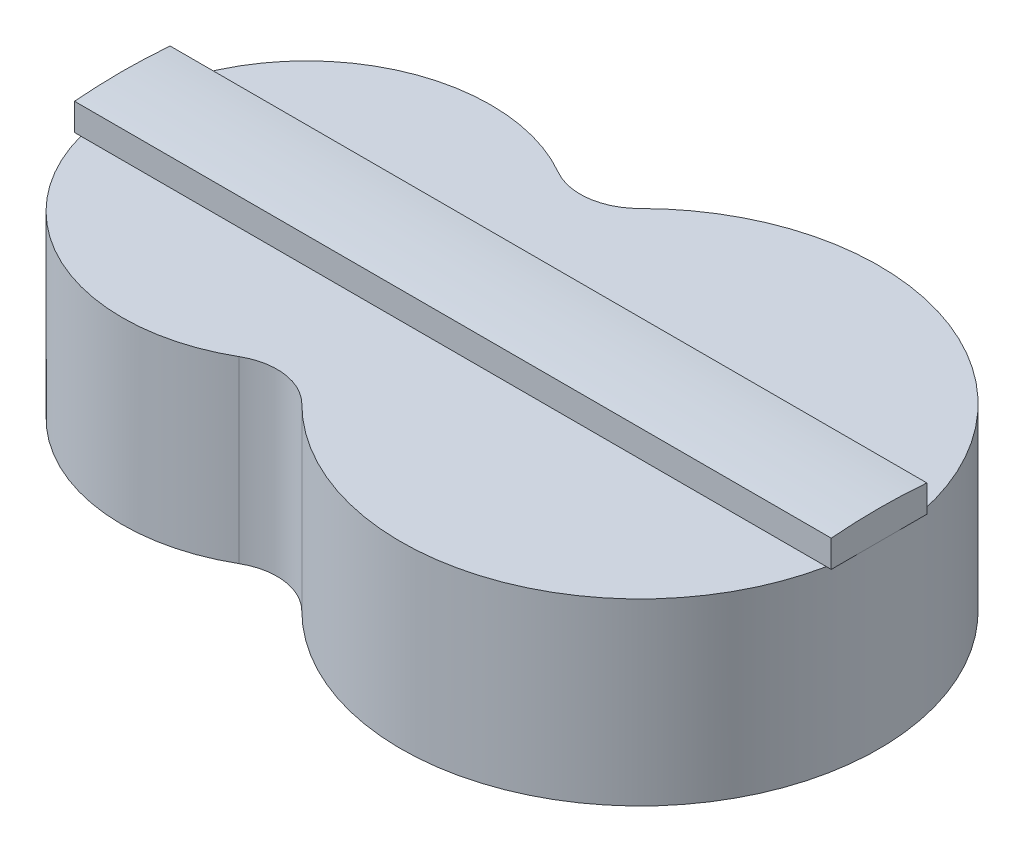
ISO-10303-21;
HEADER;
FILE_DESCRIPTION(('STEP AP214'),'2;1');
FILE_NAME('part.step','',(''),(''),'','','');
FILE_SCHEMA(('AUTOMOTIVE_DESIGN { 1 0 10303 214 1 1 1 1 }'));
ENDSEC;
DATA;
#1=APPLICATION_CONTEXT('core data for automotive mechanical design processes');
#2=APPLICATION_PROTOCOL_DEFINITION('international standard','automotive_design',2000,#1);
#3=PRODUCT_CONTEXT('',#1,'mechanical');
#4=PRODUCT('Part','Part','',(#3));
#5=PRODUCT_RELATED_PRODUCT_CATEGORY('part','',(#4));
#6=PRODUCT_DEFINITION_FORMATION('','',#4);
#7=PRODUCT_DEFINITION_CONTEXT('part definition',#1,'design');
#8=PRODUCT_DEFINITION('design','',#6,#7);
#9=PRODUCT_DEFINITION_SHAPE('','',#8);
#10=(LENGTH_UNIT() NAMED_UNIT(*) SI_UNIT(.MILLI.,.METRE.));
#11=(NAMED_UNIT(*) PLANE_ANGLE_UNIT() SI_UNIT($,.RADIAN.));
#12=(NAMED_UNIT(*) SI_UNIT($,.STERADIAN.) SOLID_ANGLE_UNIT());
#13=UNCERTAINTY_MEASURE_WITH_UNIT(LENGTH_MEASURE(1.E-05),#10,'distance_accuracy_value','');
#14=(GEOMETRIC_REPRESENTATION_CONTEXT(3) GLOBAL_UNCERTAINTY_ASSIGNED_CONTEXT((#13)) GLOBAL_UNIT_ASSIGNED_CONTEXT((#10,
#11,#12)) REPRESENTATION_CONTEXT('',''));
#15=CARTESIAN_POINT('',(0.,0.,0.));
#16=DIRECTION('',(0.,0.,1.));
#17=DIRECTION('',(1.,0.,0.));
#18=AXIS2_PLACEMENT_3D('',#15,#16,#17);
#19=CARTESIAN_POINT('',(-113.90386580231,0.,-44.194173824159));
#20=DIRECTION('',(0.,-1.,0.));
#21=DIRECTION('',(0.,0.,-1.));
#22=AXIS2_PLACEMENT_3D('',#19,#20,#21);
#23=PLANE('',#22);
#24=DIRECTION('',(-1.,0.,0.));
#25=VECTOR('',#24,1.);
#26=CARTESIAN_POINT('',(100.,0.,-20.));
#27=LINE('',#26,#25);
#28=CARTESIAN_POINT('',(97.9795897113271,0.,-20.));
#29=VERTEX_POINT('',#28);
#30=CARTESIAN_POINT('',(-213.840906621914,0.,-20.));
#31=VERTEX_POINT('',#30);
#32=EDGE_CURVE('E49',#29,#31,#27,.T.);
#33=ORIENTED_EDGE('',*,*,#32,.F.);
#34=CARTESIAN_POINT('',(0.,0.,0.));
#35=DIRECTION('',(0.,1.,0.));
#36=DIRECTION('',(0.,0.,1.));
#37=AXIS2_PLACEMENT_3D('',#34,#35,#36);
#38=CIRCLE('',#37,100.);
#39=CARTESIAN_POINT('',(-70.7106781186552,0.,-70.7106781186543));
#40=VERTEX_POINT('',#39);
#41=EDGE_CURVE('E194',#29,#40,#38,.T.);
#42=ORIENTED_EDGE('',*,*,#41,.T.);
#43=CARTESIAN_POINT('',(-88.3883476483189,0.,-88.3883476483179));
#44=DIRECTION('',(0.,-1.,0.));
#45=DIRECTION('',(0.,0.,-1.));
#46=AXIS2_PLACEMENT_3D('',#43,#44,#45);
#47=CIRCLE('',#46,25.);
#48=CARTESIAN_POINT('',(-100.888347648319,0.,-66.7377125537069));
#49=VERTEX_POINT('',#48);
#50=EDGE_CURVE('E135',#40,#49,#47,.T.);
#51=ORIENTED_EDGE('',*,*,#50,.T.);
#52=CARTESIAN_POINT('',(-139.419383956301,0.,0.));
#53=DIRECTION('',(0.,1.,0.));
#54=DIRECTION('',(0.,0.,1.));
#55=AXIS2_PLACEMENT_3D('',#52,#53,#54);
#56=CIRCLE('',#55,77.062072615965);
#57=EDGE_CURVE('E188',#49,#31,#56,.T.);
#58=ORIENTED_EDGE('',*,*,#57,.T.);
#59=EDGE_LOOP('',(#33,#42,#51,#58));
#60=FACE_BOUND('',#59,.T.);
#61=ADVANCED_FACE('F40',(#60),#23,.F.);
#62=CARTESIAN_POINT('',(-88.3883476483189,-75.,-88.3883476483179));
#63=DIRECTION('',(0.,1.,0.));
#64=DIRECTION('',(0.,0.,1.));
#65=AXIS2_PLACEMENT_3D('',#62,#63,#64);
#66=CYLINDRICAL_SURFACE('',#65,25.);
#67=ORIENTED_EDGE('',*,*,#50,.F.);
#68=DIRECTION('',(0.,1.,0.));
#69=VECTOR('',#68,1.);
#70=CARTESIAN_POINT('',(-70.7106781186552,-75.,-70.7106781186543));
#71=LINE('',#70,#69);
#72=CARTESIAN_POINT('',(-70.7106781186552,-75.,-70.7106781186543));
#73=VERTEX_POINT('',#72);
#74=EDGE_CURVE('E198',#73,#40,#71,.T.);
#75=ORIENTED_EDGE('',*,*,#74,.F.);
#76=CARTESIAN_POINT('',(-88.3883476483189,-75.,-88.3883476483179));
#77=DIRECTION('',(0.,-1.,0.));
#78=DIRECTION('',(0.,0.,-1.));
#79=AXIS2_PLACEMENT_3D('',#76,#77,#78);
#80=CIRCLE('',#79,25.);
#81=CARTESIAN_POINT('',(-100.888347648319,-75.,-66.7377125537069));
#82=VERTEX_POINT('',#81);
#83=EDGE_CURVE('E172',#73,#82,#80,.T.);
#84=ORIENTED_EDGE('',*,*,#83,.T.);
#85=DIRECTION('',(0.,1.,0.));
#86=VECTOR('',#85,1.);
#87=CARTESIAN_POINT('',(-100.888347648319,-75.,-66.7377125537069));
#88=LINE('',#87,#86);
#89=EDGE_CURVE('E44',#82,#49,#88,.T.);
#90=ORIENTED_EDGE('',*,*,#89,.T.);
#91=EDGE_LOOP('',(#67,#75,#84,#90));
#92=FACE_BOUND('',#91,.T.);
#93=ADVANCED_FACE('F42',(#92),#66,.F.);
#94=CARTESIAN_POINT('',(0.,-75.,0.));
#95=DIRECTION('',(0.,1.,0.));
#96=DIRECTION('',(0.,0.,1.));
#97=AXIS2_PLACEMENT_3D('',#94,#95,#96);
#98=CYLINDRICAL_SURFACE('',#97,100.);
#99=CARTESIAN_POINT('',(-70.7106781186552,0.,70.7106781186543));
#100=VERTEX_POINT('',#99);
#101=CARTESIAN_POINT('',(97.9795897113271,0.,20.));
#102=VERTEX_POINT('',#101);
#103=EDGE_CURVE('E176',#100,#102,#38,.T.);
#104=ORIENTED_EDGE('',*,*,#103,.F.);
#105=DIRECTION('',(0.,1.,0.));
#106=VECTOR('',#105,1.);
#107=CARTESIAN_POINT('',(-70.7106781186552,-75.,70.7106781186543));
#108=LINE('',#107,#106);
#109=CARTESIAN_POINT('',(-70.7106781186552,-75.,70.7106781186543));
#110=VERTEX_POINT('',#109);
#111=EDGE_CURVE('E201',#110,#100,#108,.T.);
#112=ORIENTED_EDGE('',*,*,#111,.F.);
#113=CARTESIAN_POINT('',(0.,-75.,0.));
#114=DIRECTION('',(0.,1.,0.));
#115=DIRECTION('',(0.,0.,1.));
#116=AXIS2_PLACEMENT_3D('',#113,#114,#115);
#117=CIRCLE('',#116,100.);
#118=EDGE_CURVE('E182',#110,#73,#117,.T.);
#119=ORIENTED_EDGE('',*,*,#118,.T.);
#120=ORIENTED_EDGE('',*,*,#74,.T.);
#121=ORIENTED_EDGE('',*,*,#41,.F.);
#122=CARTESIAN_POINT('',(100.,0.,0.));
#123=VERTEX_POINT('',#122);
#124=EDGE_CURVE('E65',#123,#29,#38,.T.);
#125=ORIENTED_EDGE('',*,*,#124,.F.);
#126=EDGE_CURVE('E197',#102,#123,#38,.T.);
#127=ORIENTED_EDGE('',*,*,#126,.F.);
#128=EDGE_LOOP('',(#104,#112,#119,#120,#121,#125,#127));
#129=FACE_BOUND('',#128,.T.);
#130=ADVANCED_FACE('F216',(#129),#98,.T.);
#131=CARTESIAN_POINT('',(-88.3883476483189,-75.,88.3883476483179));
#132=DIRECTION('',(0.,1.,0.));
#133=DIRECTION('',(0.,0.,1.));
#134=AXIS2_PLACEMENT_3D('',#131,#132,#133);
#135=CYLINDRICAL_SURFACE('',#134,25.);
#136=CARTESIAN_POINT('',(-88.3883476483189,0.,88.3883476483179));
#137=DIRECTION('',(0.,-1.,0.));
#138=DIRECTION('',(0.,0.,1.));
#139=AXIS2_PLACEMENT_3D('',#136,#137,#138);
#140=CIRCLE('',#139,25.);
#141=CARTESIAN_POINT('',(-100.888347648319,0.,66.7377125537069));
#142=VERTEX_POINT('',#141);
#143=EDGE_CURVE('E190',#142,#100,#140,.T.);
#144=ORIENTED_EDGE('',*,*,#143,.F.);
#145=DIRECTION('',(0.,1.,0.));
#146=VECTOR('',#145,1.);
#147=CARTESIAN_POINT('',(-100.888347648319,-75.,66.7377125537069));
#148=LINE('',#147,#146);
#149=CARTESIAN_POINT('',(-100.888347648319,-75.,66.7377125537069));
#150=VERTEX_POINT('',#149);
#151=EDGE_CURVE('E202',#150,#142,#148,.T.);
#152=ORIENTED_EDGE('',*,*,#151,.F.);
#153=CARTESIAN_POINT('',(-88.3883476483189,-75.,88.3883476483179));
#154=DIRECTION('',(0.,-1.,0.));
#155=DIRECTION('',(0.,0.,1.));
#156=AXIS2_PLACEMENT_3D('',#153,#154,#155);
#157=CIRCLE('',#156,25.);
#158=EDGE_CURVE('E179',#150,#110,#157,.T.);
#159=ORIENTED_EDGE('',*,*,#158,.T.);
#160=ORIENTED_EDGE('',*,*,#111,.T.);
#161=EDGE_LOOP('',(#144,#152,#159,#160));
#162=FACE_BOUND('',#161,.T.);
#163=ADVANCED_FACE('F222',(#162),#135,.F.);
#164=CARTESIAN_POINT('',(-139.419383956301,-75.,0.));
#165=DIRECTION('',(0.,1.,0.));
#166=DIRECTION('',(0.,0.,1.));
#167=AXIS2_PLACEMENT_3D('',#164,#165,#166);
#168=CYLINDRICAL_SURFACE('',#167,77.062072615965);
#169=ORIENTED_EDGE('',*,*,#57,.F.);
#170=ORIENTED_EDGE('',*,*,#89,.F.);
#171=CARTESIAN_POINT('',(-139.419383956301,-75.,0.));
#172=DIRECTION('',(0.,1.,0.));
#173=DIRECTION('',(0.,0.,1.));
#174=AXIS2_PLACEMENT_3D('',#171,#172,#173);
#175=CIRCLE('',#174,77.062072615965);
#176=EDGE_CURVE('E175',#82,#150,#175,.T.);
#177=ORIENTED_EDGE('',*,*,#176,.T.);
#178=ORIENTED_EDGE('',*,*,#151,.T.);
#179=CARTESIAN_POINT('',(-213.840906621914,0.,20.));
#180=VERTEX_POINT('',#179);
#181=EDGE_CURVE('E187',#180,#142,#56,.T.);
#182=ORIENTED_EDGE('',*,*,#181,.F.);
#183=CARTESIAN_POINT('',(-216.481456572266,0.,0.));
#184=VERTEX_POINT('',#183);
#185=EDGE_CURVE('E241',#184,#180,#56,.T.);
#186=ORIENTED_EDGE('',*,*,#185,.F.);
#187=EDGE_CURVE('E191',#31,#184,#56,.T.);
#188=ORIENTED_EDGE('',*,*,#187,.F.);
#189=EDGE_LOOP('',(#169,#170,#177,#178,#182,#186,#188));
#190=FACE_BOUND('',#189,.T.);
#191=ADVANCED_FACE('F213',(#190),#168,.T.);
#192=CARTESIAN_POINT('',(-113.90386580231,-75.,-44.194173824159));
#193=DIRECTION('',(0.,-1.,0.));
#194=DIRECTION('',(0.,0.,-1.));
#195=AXIS2_PLACEMENT_3D('',#192,#193,#194);
#196=PLANE('',#195);
#197=ORIENTED_EDGE('',*,*,#83,.F.);
#198=ORIENTED_EDGE('',*,*,#118,.F.);
#199=ORIENTED_EDGE('',*,*,#158,.F.);
#200=ORIENTED_EDGE('',*,*,#176,.F.);
#201=EDGE_LOOP('',(#197,#198,#199,#200));
#202=FACE_BOUND('',#201,.T.);
#203=ADVANCED_FACE('F219',(#202),#196,.T.);
#204=ORIENTED_EDGE('',*,*,#103,.T.);
#205=DIRECTION('',(-1.,0.,0.));
#206=VECTOR('',#205,1.);
#207=CARTESIAN_POINT('',(100.,0.,20.));
#208=LINE('',#207,#206);
#209=EDGE_CURVE('E11',#102,#180,#208,.T.);
#210=ORIENTED_EDGE('',*,*,#209,.T.);
#211=ORIENTED_EDGE('',*,*,#181,.T.);
#212=ORIENTED_EDGE('',*,*,#143,.T.);
#213=EDGE_LOOP('',(#204,#210,#211,#212));
#214=FACE_BOUND('',#213,.T.);
#215=ADVANCED_FACE('F224',(#214),#23,.F.);
#216=CARTESIAN_POINT('',(100.,0.,-20.));
#217=DIRECTION('',(0.,-1.,0.));
#218=DIRECTION('',(0.,0.,-1.));
#219=AXIS2_PLACEMENT_3D('',#216,#217,#218);
#220=PLANE('',#219);
#221=CARTESIAN_POINT('',(-216.481456572266,0.,-20.));
#222=VERTEX_POINT('',#221);
#223=EDGE_CURVE('E150',#31,#222,#27,.T.);
#224=ORIENTED_EDGE('',*,*,#223,.F.);
#225=ORIENTED_EDGE('',*,*,#187,.T.);
#226=DIRECTION('',(0.,0.,1.));
#227=VECTOR('',#226,1.);
#228=CARTESIAN_POINT('',(-216.481456572266,0.,-20.));
#229=LINE('',#228,#227);
#230=EDGE_CURVE('E156',#222,#184,#229,.T.);
#231=ORIENTED_EDGE('',*,*,#230,.F.);
#232=EDGE_LOOP('',(#224,#225,#231));
#233=FACE_BOUND('',#232,.T.);
#234=ADVANCED_FACE('F246',(#233),#220,.T.);
#235=CARTESIAN_POINT('',(-216.481456572266,0.,20.));
#236=VERTEX_POINT('',#235);
#237=EDGE_CURVE('E155',#184,#236,#229,.T.);
#238=ORIENTED_EDGE('',*,*,#237,.F.);
#239=ORIENTED_EDGE('',*,*,#185,.T.);
#240=EDGE_CURVE('E52',#180,#236,#208,.T.);
#241=ORIENTED_EDGE('',*,*,#240,.T.);
#242=EDGE_LOOP('',(#238,#239,#241));
#243=FACE_BOUND('',#242,.T.);
#244=ADVANCED_FACE('F244',(#243),#220,.T.);
#245=CARTESIAN_POINT('',(100.,0.,20.));
#246=VERTEX_POINT('',#245);
#247=EDGE_CURVE('E51',#246,#102,#208,.T.);
#248=ORIENTED_EDGE('',*,*,#247,.T.);
#249=ORIENTED_EDGE('',*,*,#126,.T.);
#250=DIRECTION('',(0.,0.,1.));
#251=VECTOR('',#250,1.);
#252=CARTESIAN_POINT('',(100.,0.,-20.));
#253=LINE('',#252,#251);
#254=EDGE_CURVE('E164',#123,#246,#253,.T.);
#255=ORIENTED_EDGE('',*,*,#254,.T.);
#256=EDGE_LOOP('',(#248,#249,#255));
#257=FACE_BOUND('',#256,.T.);
#258=ADVANCED_FACE('F235',(#257),#220,.T.);
#259=CARTESIAN_POINT('',(100.,0.,-20.));
#260=DIRECTION('',(0.,0.,1.));
#261=DIRECTION('',(1.,0.,0.));
#262=AXIS2_PLACEMENT_3D('',#259,#260,#261);
#263=PLANE('',#262);
#264=CARTESIAN_POINT('',(100.,0.,-20.));
#265=VERTEX_POINT('',#264);
#266=EDGE_CURVE('E168',#265,#29,#27,.T.);
#267=ORIENTED_EDGE('',*,*,#266,.T.);
#268=ORIENTED_EDGE('',*,*,#32,.T.);
#269=ORIENTED_EDGE('',*,*,#223,.T.);
#270=DIRECTION('',(0.,1.,0.));
#271=VECTOR('',#270,1.);
#272=CARTESIAN_POINT('',(-216.481456572266,0.,-20.));
#273=LINE('',#272,#271);
#274=CARTESIAN_POINT('',(-216.481456572266,11.3262220766032,-20.));
#275=VERTEX_POINT('',#274);
#276=EDGE_CURVE('E143',#222,#275,#273,.T.);
#277=ORIENTED_EDGE('',*,*,#276,.T.);
#278=DIRECTION('',(-1.,0.,0.));
#279=VECTOR('',#278,1.);
#280=CARTESIAN_POINT('',(100.,11.3262220766032,-20.));
#281=LINE('',#280,#279);
#282=CARTESIAN_POINT('',(100.,11.3262220766032,-20.));
#283=VERTEX_POINT('',#282);
#284=EDGE_CURVE('E125',#283,#275,#281,.T.);
#285=ORIENTED_EDGE('',*,*,#284,.F.);
#286=DIRECTION('',(0.,1.,0.));
#287=VECTOR('',#286,1.);
#288=CARTESIAN_POINT('',(100.,0.,-20.));
#289=LINE('',#288,#287);
#290=EDGE_CURVE('E158',#265,#283,#289,.T.);
#291=ORIENTED_EDGE('',*,*,#290,.F.);
#292=EDGE_LOOP('',(#267,#268,#269,#277,#285,#291));
#293=FACE_BOUND('',#292,.T.);
#294=ADVANCED_FACE('F148',(#293),#263,.F.);
#295=CARTESIAN_POINT('',(100.,-225.,0.));
#296=DIRECTION('',(-1.,0.,0.));
#297=DIRECTION('',(0.,0.,1.));
#298=AXIS2_PLACEMENT_3D('',#295,#296,#297);
#299=CYLINDRICAL_SURFACE('',#298,237.171);
#300=ORIENTED_EDGE('',*,*,#284,.T.);
#301=CARTESIAN_POINT('',(-216.481456572266,-225.,0.));
#302=DIRECTION('',(1.,0.,0.));
#303=DIRECTION('',(0.,0.,-1.));
#304=AXIS2_PLACEMENT_3D('',#301,#302,#303);
#305=CIRCLE('',#304,237.171);
#306=CARTESIAN_POINT('',(-216.481456572266,11.3262220766032,19.9999999999999));
#307=VERTEX_POINT('',#306);
#308=EDGE_CURVE('E129',#275,#307,#305,.T.);
#309=ORIENTED_EDGE('',*,*,#308,.T.);
#310=DIRECTION('',(-1.,0.,0.));
#311=VECTOR('',#310,1.);
#312=CARTESIAN_POINT('',(100.,11.3262220766032,19.9999999999999));
#313=LINE('',#312,#311);
#314=CARTESIAN_POINT('',(100.,11.3262220766032,19.9999999999999));
#315=VERTEX_POINT('',#314);
#316=EDGE_CURVE('E136',#315,#307,#313,.T.);
#317=ORIENTED_EDGE('',*,*,#316,.F.);
#318=CARTESIAN_POINT('',(100.,-225.,0.));
#319=DIRECTION('',(1.,0.,0.));
#320=DIRECTION('',(0.,0.,-1.));
#321=AXIS2_PLACEMENT_3D('',#318,#319,#320);
#322=CIRCLE('',#321,237.171);
#323=EDGE_CURVE('E130',#283,#315,#322,.T.);
#324=ORIENTED_EDGE('',*,*,#323,.F.);
#325=EDGE_LOOP('',(#300,#309,#317,#324));
#326=FACE_BOUND('',#325,.T.);
#327=ADVANCED_FACE('F127',(#326),#299,.T.);
#328=CARTESIAN_POINT('',(100.,0.,20.));
#329=DIRECTION('',(0.,0.,1.));
#330=DIRECTION('',(0.,-1.,0.));
#331=AXIS2_PLACEMENT_3D('',#328,#329,#330);
#332=PLANE('',#331);
#333=ORIENTED_EDGE('',*,*,#316,.T.);
#334=DIRECTION('',(0.,1.,0.));
#335=VECTOR('',#334,1.);
#336=CARTESIAN_POINT('',(-216.481456572266,0.,20.));
#337=LINE('',#336,#335);
#338=EDGE_CURVE('E145',#236,#307,#337,.T.);
#339=ORIENTED_EDGE('',*,*,#338,.F.);
#340=ORIENTED_EDGE('',*,*,#240,.F.);
#341=ORIENTED_EDGE('',*,*,#209,.F.);
#342=ORIENTED_EDGE('',*,*,#247,.F.);
#343=DIRECTION('',(0.,1.,0.));
#344=VECTOR('',#343,1.);
#345=CARTESIAN_POINT('',(100.,0.,20.));
#346=LINE('',#345,#344);
#347=EDGE_CURVE('E161',#246,#315,#346,.T.);
#348=ORIENTED_EDGE('',*,*,#347,.T.);
#349=EDGE_LOOP('',(#333,#339,#340,#341,#342,#348));
#350=FACE_BOUND('',#349,.T.);
#351=ADVANCED_FACE('F237',(#350),#332,.T.);
#352=EDGE_CURVE('E165',#265,#123,#253,.T.);
#353=ORIENTED_EDGE('',*,*,#352,.T.);
#354=ORIENTED_EDGE('',*,*,#124,.T.);
#355=ORIENTED_EDGE('',*,*,#266,.F.);
#356=EDGE_LOOP('',(#353,#354,#355));
#357=FACE_BOUND('',#356,.T.);
#358=ADVANCED_FACE('F229',(#357),#220,.T.);
#359=CARTESIAN_POINT('',(100.,-225.,0.));
#360=DIRECTION('',(1.,0.,0.));
#361=DIRECTION('',(0.,0.,-1.));
#362=AXIS2_PLACEMENT_3D('',#359,#360,#361);
#363=PLANE('',#362);
#364=ORIENTED_EDGE('',*,*,#290,.T.);
#365=ORIENTED_EDGE('',*,*,#323,.T.);
#366=ORIENTED_EDGE('',*,*,#347,.F.);
#367=ORIENTED_EDGE('',*,*,#254,.F.);
#368=ORIENTED_EDGE('',*,*,#352,.F.);
#369=EDGE_LOOP('',(#364,#365,#366,#367,#368));
#370=FACE_BOUND('',#369,.T.);
#371=ADVANCED_FACE('F232',(#370),#363,.T.);
#372=CARTESIAN_POINT('',(-216.481456572266,-225.,0.));
#373=DIRECTION('',(1.,0.,0.));
#374=DIRECTION('',(0.,0.,-1.));
#375=AXIS2_PLACEMENT_3D('',#372,#373,#374);
#376=PLANE('',#375);
#377=ORIENTED_EDGE('',*,*,#276,.F.);
#378=ORIENTED_EDGE('',*,*,#230,.T.);
#379=ORIENTED_EDGE('',*,*,#237,.T.);
#380=ORIENTED_EDGE('',*,*,#338,.T.);
#381=ORIENTED_EDGE('',*,*,#308,.F.);
#382=EDGE_LOOP('',(#377,#378,#379,#380,#381));
#383=FACE_BOUND('',#382,.T.);
#384=ADVANCED_FACE('F141',(#383),#376,.F.);
#385=CLOSED_SHELL('',(#61,#93,#130,#163,#191,#203,#215,#234,#244,#258,#294,#327,#351,#358,#371,#384));
#386=MANIFOLD_SOLID_BREP('B2',#385);
#387=ADVANCED_BREP_SHAPE_REPRESENTATION('',(#18,#386),#14);
#388=SHAPE_DEFINITION_REPRESENTATION(#9,#387);
ENDSEC;
END-ISO-10303-21;
